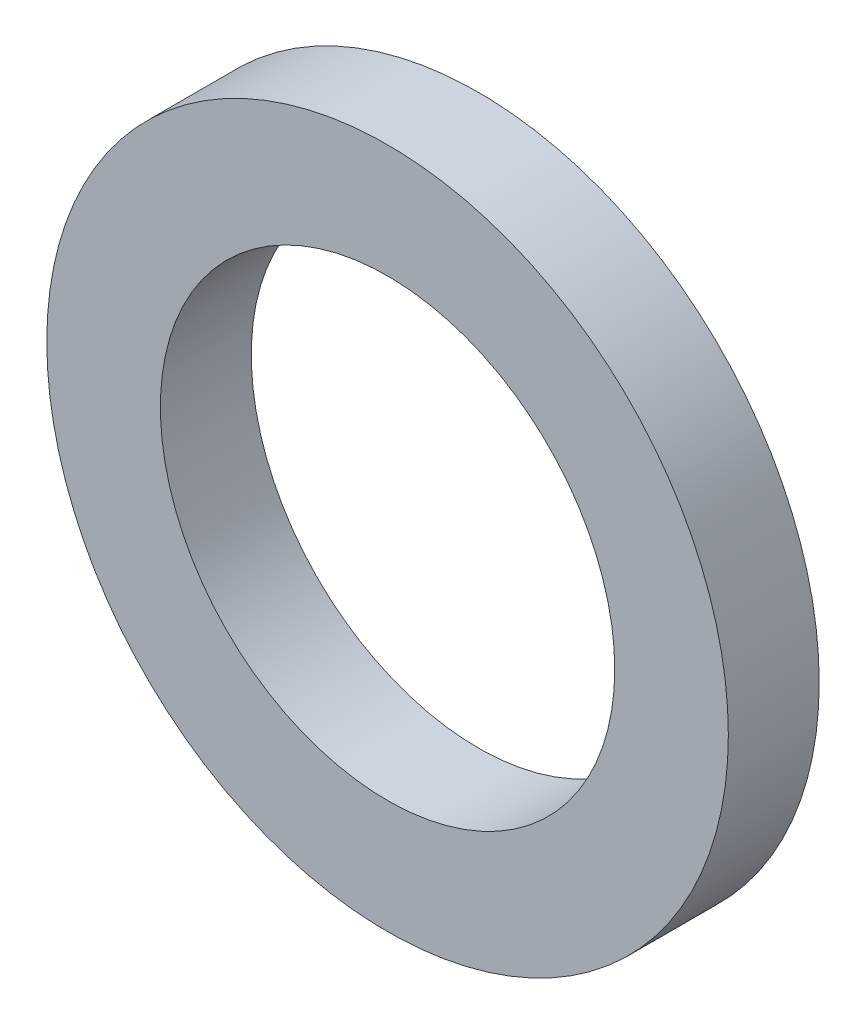
ISO-10303-21;
HEADER;
FILE_DESCRIPTION(('STEP AP214'),'2;1');
FILE_NAME('part.step','',(''),(''),'','','');
FILE_SCHEMA(('AUTOMOTIVE_DESIGN { 1 0 10303 214 1 1 1 1 }'));
ENDSEC;
DATA;
#1=APPLICATION_CONTEXT('core data for automotive mechanical design processes');
#2=APPLICATION_PROTOCOL_DEFINITION('international standard','automotive_design',2000,#1);
#3=PRODUCT_CONTEXT('',#1,'mechanical');
#4=PRODUCT('Part','Part','',(#3));
#5=PRODUCT_RELATED_PRODUCT_CATEGORY('part','',(#4));
#6=PRODUCT_DEFINITION_FORMATION('','',#4);
#7=PRODUCT_DEFINITION_CONTEXT('part definition',#1,'design');
#8=PRODUCT_DEFINITION('design','',#6,#7);
#9=PRODUCT_DEFINITION_SHAPE('','',#8);
#10=(LENGTH_UNIT() NAMED_UNIT(*) SI_UNIT(.MILLI.,.METRE.));
#11=(NAMED_UNIT(*) PLANE_ANGLE_UNIT() SI_UNIT($,.RADIAN.));
#12=(NAMED_UNIT(*) SI_UNIT($,.STERADIAN.) SOLID_ANGLE_UNIT());
#13=UNCERTAINTY_MEASURE_WITH_UNIT(LENGTH_MEASURE(1.E-05),#10,'distance_accuracy_value','');
#14=(GEOMETRIC_REPRESENTATION_CONTEXT(3) GLOBAL_UNCERTAINTY_ASSIGNED_CONTEXT((#13)) GLOBAL_UNIT_ASSIGNED_CONTEXT((#10,
#11,#12)) REPRESENTATION_CONTEXT('',''));
#15=CARTESIAN_POINT('',(0.,0.,0.));
#16=DIRECTION('',(0.,0.,1.));
#17=DIRECTION('',(1.,0.,0.));
#18=AXIS2_PLACEMENT_3D('',#15,#16,#17);
#19=CARTESIAN_POINT('',(0.,0.,0.2));
#20=DIRECTION('',(0.,0.,1.));
#21=DIRECTION('',(1.,0.,0.));
#22=AXIS2_PLACEMENT_3D('',#19,#20,#21);
#23=PLANE('',#22);
#24=CARTESIAN_POINT('',(0.,0.,0.2));
#25=DIRECTION('',(0.,0.,1.));
#26=DIRECTION('',(1.,0.,0.));
#27=AXIS2_PLACEMENT_3D('',#24,#25,#26);
#28=CIRCLE('',#27,0.75);
#29=CARTESIAN_POINT('',(0.75,0.,0.2));
#30=VERTEX_POINT('',#29);
#31=EDGE_CURVE('E10',#30,#30,#28,.T.);
#32=ORIENTED_EDGE('',*,*,#31,.T.);
#33=EDGE_LOOP('',(#32));
#34=FACE_BOUND('',#33,.T.);
#35=CARTESIAN_POINT('',(0.,0.,0.2));
#36=DIRECTION('',(0.,0.,1.));
#37=DIRECTION('',(1.,0.,0.));
#38=AXIS2_PLACEMENT_3D('',#35,#36,#37);
#39=CIRCLE('',#38,0.5);
#40=CARTESIAN_POINT('',(0.5,0.,0.2));
#41=VERTEX_POINT('',#40);
#42=EDGE_CURVE('E41',#41,#41,#39,.T.);
#43=ORIENTED_EDGE('',*,*,#42,.F.);
#44=EDGE_LOOP('',(#43));
#45=FACE_BOUND('',#44,.T.);
#46=ADVANCED_FACE('F30',(#34,#45),#23,.T.);
#47=CARTESIAN_POINT('',(0.,0.,0.));
#48=DIRECTION('',(0.,0.,1.));
#49=DIRECTION('',(1.,0.,0.));
#50=AXIS2_PLACEMENT_3D('',#47,#48,#49);
#51=PLANE('',#50);
#52=CARTESIAN_POINT('',(0.,0.,0.));
#53=DIRECTION('',(0.,0.,1.));
#54=DIRECTION('',(1.,0.,0.));
#55=AXIS2_PLACEMENT_3D('',#52,#53,#54);
#56=CIRCLE('',#55,0.75);
#57=CARTESIAN_POINT('',(0.75,0.,0.));
#58=VERTEX_POINT('',#57);
#59=EDGE_CURVE('E34',#58,#58,#56,.T.);
#60=ORIENTED_EDGE('',*,*,#59,.F.);
#61=EDGE_LOOP('',(#60));
#62=FACE_BOUND('',#61,.T.);
#63=CARTESIAN_POINT('',(0.,0.,0.));
#64=DIRECTION('',(0.,0.,1.));
#65=DIRECTION('',(1.,0.,0.));
#66=AXIS2_PLACEMENT_3D('',#63,#64,#65);
#67=CIRCLE('',#66,0.5);
#68=CARTESIAN_POINT('',(0.5,0.,0.));
#69=VERTEX_POINT('',#68);
#70=EDGE_CURVE('E43',#69,#69,#67,.T.);
#71=ORIENTED_EDGE('',*,*,#70,.T.);
#72=EDGE_LOOP('',(#71));
#73=FACE_BOUND('',#72,.T.);
#74=ADVANCED_FACE('F53',(#62,#73),#51,.F.);
#75=CARTESIAN_POINT('',(0.,0.,0.2));
#76=DIRECTION('',(0.,0.,-1.));
#77=DIRECTION('',(-1.,0.,0.));
#78=AXIS2_PLACEMENT_3D('',#75,#76,#77);
#79=CYLINDRICAL_SURFACE('',#78,0.75);
#80=ORIENTED_EDGE('',*,*,#31,.F.);
#81=EDGE_LOOP('',(#80));
#82=FACE_BOUND('',#81,.T.);
#83=ORIENTED_EDGE('',*,*,#59,.T.);
#84=EDGE_LOOP('',(#83));
#85=FACE_BOUND('',#84,.T.);
#86=ADVANCED_FACE('F32',(#82,#85),#79,.T.);
#87=CARTESIAN_POINT('',(0.,0.,0.2));
#88=DIRECTION('',(0.,0.,-1.));
#89=DIRECTION('',(-1.,0.,0.));
#90=AXIS2_PLACEMENT_3D('',#87,#88,#89);
#91=CYLINDRICAL_SURFACE('',#90,0.5);
#92=ORIENTED_EDGE('',*,*,#42,.T.);
#93=EDGE_LOOP('',(#92));
#94=FACE_BOUND('',#93,.T.);
#95=ORIENTED_EDGE('',*,*,#70,.F.);
#96=EDGE_LOOP('',(#95));
#97=FACE_BOUND('',#96,.T.);
#98=ADVANCED_FACE('F49',(#94,#97),#91,.F.);
#99=CLOSED_SHELL('',(#46,#74,#86,#98));
#100=MANIFOLD_SOLID_BREP('B2',#99);
#101=ADVANCED_BREP_SHAPE_REPRESENTATION('',(#18,#100),#14);
#102=SHAPE_DEFINITION_REPRESENTATION(#9,#101);
ENDSEC;
END-ISO-10303-21;
